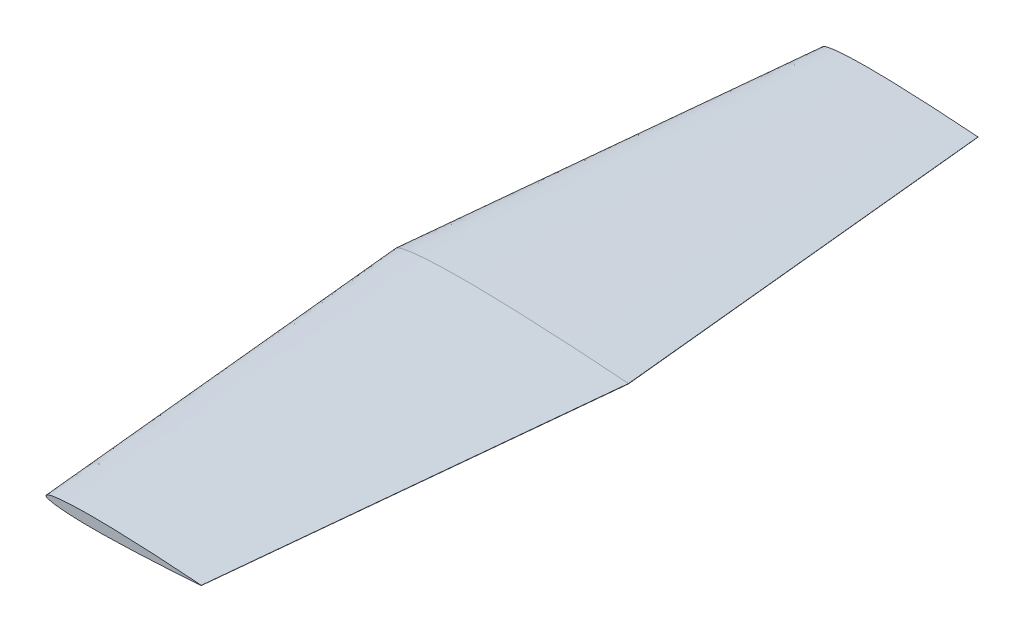
ISO-10303-21;
HEADER;
FILE_DESCRIPTION(('STEP AP214'),'2;1');
FILE_NAME('part.step','',(''),(''),'','','');
FILE_SCHEMA(('AUTOMOTIVE_DESIGN { 1 0 10303 214 1 1 1 1 }'));
ENDSEC;
DATA;
#1=APPLICATION_CONTEXT('core data for automotive mechanical design processes');
#2=APPLICATION_PROTOCOL_DEFINITION('international standard','automotive_design',2000,#1);
#3=PRODUCT_CONTEXT('',#1,'mechanical');
#4=PRODUCT('Part','Part','',(#3));
#5=PRODUCT_RELATED_PRODUCT_CATEGORY('part','',(#4));
#6=PRODUCT_DEFINITION_FORMATION('','',#4);
#7=PRODUCT_DEFINITION_CONTEXT('part definition',#1,'design');
#8=PRODUCT_DEFINITION('design','',#6,#7);
#9=PRODUCT_DEFINITION_SHAPE('','',#8);
#10=(LENGTH_UNIT() NAMED_UNIT(*) SI_UNIT(.MILLI.,.METRE.));
#11=(NAMED_UNIT(*) PLANE_ANGLE_UNIT() SI_UNIT($,.RADIAN.));
#12=(NAMED_UNIT(*) SI_UNIT($,.STERADIAN.) SOLID_ANGLE_UNIT());
#13=UNCERTAINTY_MEASURE_WITH_UNIT(LENGTH_MEASURE(1.E-05),#10,'distance_accuracy_value','');
#14=(GEOMETRIC_REPRESENTATION_CONTEXT(3) GLOBAL_UNCERTAINTY_ASSIGNED_CONTEXT((#13)) GLOBAL_UNIT_ASSIGNED_CONTEXT((#10,
#11,#12)) REPRESENTATION_CONTEXT('',''));
#15=CARTESIAN_POINT('',(0.,0.,0.));
#16=DIRECTION('',(0.,0.,1.));
#17=DIRECTION('',(1.,0.,0.));
#18=AXIS2_PLACEMENT_3D('',#15,#16,#17);
#19=CARTESIAN_POINT('',(30.4800001226268,0.000349459675954821,304.8));
#20=DIRECTION('',(0.,0.,-1.));
#21=DIRECTION('',(-1.,0.,0.));
#22=AXIS2_PLACEMENT_3D('',#19,#20,#21);
#23=PLANE('',#22);
#24=CARTESIAN_POINT('',(152.4,0.,304.8));
#25=CARTESIAN_POINT('',(147.533653871082,0.38251094407834,304.8));
#26=CARTESIAN_POINT('',(137.833966293067,1.08897194712108,304.8));
#27=CARTESIAN_POINT('',(122.258297932429,2.08093581236501,304.8));
#28=CARTESIAN_POINT('',(106.807179241957,2.91624861625816,304.8));
#29=CARTESIAN_POINT('',(93.009840409047,3.50614621448431,304.8));
#30=CARTESIAN_POINT('',(81.9861263173243,3.84811026205105,304.8));
#31=CARTESIAN_POINT('',(72.7605207886575,4.02349433648937,304.8));
#32=CARTESIAN_POINT('',(63.9941426865938,4.0558165498287,304.8));
#33=CARTESIAN_POINT('',(57.0756497707235,3.94665076386842,304.8));
#34=CARTESIAN_POINT('',(51.9325294626256,3.76714749278911,304.8));
#35=CARTESIAN_POINT('',(48.4242684817791,3.59398385287236,304.8));
#36=CARTESIAN_POINT('',(45.1810225085514,3.38060508510462,304.8));
#37=CARTESIAN_POINT('',(42.2227177919065,3.12849009249765,304.8));
#38=CARTESIAN_POINT('',(39.5674648043959,2.8406056454015,304.8));
#39=CARTESIAN_POINT('',(37.2314111811434,2.52015422985372,304.8));
#40=CARTESIAN_POINT('',(35.2281616987781,2.17127756223696,304.8));
#41=CARTESIAN_POINT('',(33.5699899186169,1.79622978628432,304.8));
#42=CARTESIAN_POINT('',(32.2612918625158,1.40457182472168,304.8));
#43=CARTESIAN_POINT('',(31.3100638756045,0.98677947663402,304.8));
#44=CARTESIAN_POINT('',(30.6796340067174,0.566158578880305,304.8));
#45=CARTESIAN_POINT('',(30.3981273738036,0.000406923399632427,304.8));
#46=CARTESIAN_POINT('',(30.6788395657118,-0.565739334529939,304.8));
#47=CARTESIAN_POINT('',(31.3086783744998,-0.987244772403172,304.8));
#48=CARTESIAN_POINT('',(32.2593189557769,-1.4063719779545,304.8));
#49=CARTESIAN_POINT('',(33.5674659397252,-1.79986661487492,304.8));
#50=CARTESIAN_POINT('',(35.2251096196686,-2.17724164997093,304.8));
#51=CARTESIAN_POINT('',(37.2278673990544,-2.52892999910048,304.8));
#52=CARTESIAN_POINT('',(39.5634688928718,-2.85266029196128,304.8));
#53=CARTESIAN_POINT('',(42.2183151517549,-3.14427171879218,304.8));
#54=CARTESIAN_POINT('',(45.176263051921,-3.40053912975998,304.8));
#55=CARTESIAN_POINT('',(49.6702369802134,-3.70254168714988,304.8));
#56=CARTESIAN_POINT('',(55.8970983238272,-3.96304546156846,304.8));
#57=CARTESIAN_POINT('',(63.9884216246175,-4.10216132772887,304.8));
#58=CARTESIAN_POINT('',(72.7548365500238,-4.0820872303255,304.8));
#59=CARTESIAN_POINT('',(83.5758846244706,-3.8915400795507,304.8));
#60=CARTESIAN_POINT('',(94.5992120483107,-3.53219186224239,304.8));
#61=CARTESIAN_POINT('',(107.003167037018,-2.99906507109771,304.8));
#62=CARTESIAN_POINT('',(118.606585566789,-2.40431872015219,304.8));
#63=CARTESIAN_POINT('',(132.638123697716,-1.57653391106616,304.8));
#64=CARTESIAN_POINT('',(143.669870137525,-0.830089724390264,304.8));
#65=CARTESIAN_POINT('',(150.790621778329,-0.294664462290499,304.8));
#66=CARTESIAN_POINT('',(152.337250862248,-0.175278514748908,304.8));
#67=CARTESIAN_POINT('',(152.399880371046,-0.170444076207932,304.8));
#68=B_SPLINE_CURVE_WITH_KNOTS('',3,(#24,#25,#26,#27,#28,#29,#30,#31,#32,#33,#34,#35,#36,#37,#38,
#39,#40,#41,#42,#43,#44,#45,#46,#47,#48,#49,#50,#51,#52,#53,#54,#55,#56,#57,#58,#59,#60,#61,#62,
#63,#64,#65,#66,#67),.UNSPECIFIED.,.F.,.F.,(4,1,1,1,1,1,1,1,1,1,1,1,1,1,1,1,1,1,1,1,1,1,1,1,1,1,
1,1,1,1,1,1,1,1,1,1,1,1,1,1,1,4),(0.,0.0596259329175186,0.118794316145622,0.190640969797917,
0.248634388187655,0.287480222013132,0.325358639441238,0.361342977619647,0.394558133703493,
0.409873175250072,0.424202725033005,0.437462162530302,0.44957308952056,0.460466924896069,
0.470082555788664,0.478371165069195,0.485296058318901,0.490841915805551,0.495027345223261,
0.497956576323911,0.5,0.502043423676089,0.504972654776739,0.509158084194449,0.514703941681099,
0.521628834930805,0.529917444211336,0.539533075103931,0.55042691047944,0.562537837469698,
0.575797274966995,0.605441866296506,0.638657022380353,0.674641360558762,0.712519777986868,
0.770853679587024,0.809359030202083,0.864173424708743,0.912774372266273,0.981051672806997,
0.999232702632466,1.),.UNSPECIFIED.);
#69=CARTESIAN_POINT('',(152.4,0.,304.8));
#70=VERTEX_POINT('',#69);
#71=CARTESIAN_POINT('',(152.399880371046,-0.170444076207932,304.8));
#72=VERTEX_POINT('',#71);
#73=EDGE_CURVE('E103',#70,#72,#68,.T.);
#74=ORIENTED_EDGE('',*,*,#73,.T.);
#75=DIRECTION('',(0.00070186613205375,0.999999753691936,0.));
#76=VECTOR('',#75,1.);
#77=CARTESIAN_POINT('',(152.4,0.,304.8));
#78=LINE('',#77,#76);
#79=EDGE_CURVE('E12',#72,#70,#78,.T.);
#80=ORIENTED_EDGE('',*,*,#79,.T.);
#81=EDGE_LOOP('',(#74,#80));
#82=FACE_BOUND('',#81,.T.);
#83=ADVANCED_FACE('F93',(#82),#23,.F.);
#84=CARTESIAN_POINT('',(182.88,0.,0.));
#85=CARTESIAN_POINT('',(152.4,0.,304.8));
#86=CARTESIAN_POINT('',(175.580480806622,0.573766416117493,0.));
#87=CARTESIAN_POINT('',(147.533653871082,0.38251094407834,304.8));
#88=CARTESIAN_POINT('',(161.030949439601,1.63345792068157,0.));
#89=CARTESIAN_POINT('',(137.833966293067,1.08897194712108,304.8));
#90=CARTESIAN_POINT('',(137.667446898643,3.12140371854741,0.));
#91=CARTESIAN_POINT('',(122.258297932429,2.08093581236501,304.8));
#92=CARTESIAN_POINT('',(114.490768862935,4.37437292438708,0.));
#93=CARTESIAN_POINT('',(106.807179241957,2.91624861625816,304.8));
#94=CARTESIAN_POINT('',(93.7947606135705,5.25921932172626,0.));
#95=CARTESIAN_POINT('',(93.009840409047,3.50614621448431,304.8));
#96=CARTESIAN_POINT('',(77.2591894759865,5.77216539307632,0.));
#97=CARTESIAN_POINT('',(81.9861263173243,3.84811026205105,304.8));
#98=CARTESIAN_POINT('',(63.4207811829863,6.03524150473379,0.));
#99=CARTESIAN_POINT('',(72.7605207886575,4.02349433648937,304.8));
#100=CARTESIAN_POINT('',(50.2712140298907,6.08372482474274,0.));
#101=CARTESIAN_POINT('',(63.9941426865938,4.0558165498287,304.8));
#102=CARTESIAN_POINT('',(39.8934746560852,5.9199761458023,0.));
#103=CARTESIAN_POINT('',(57.0756497707235,3.94665076386842,304.8));
#104=CARTESIAN_POINT('',(32.1787941939384,5.65072123918332,0.));
#105=CARTESIAN_POINT('',(51.9325294626256,3.76714749278911,304.8));
#106=CARTESIAN_POINT('',(26.9164027226685,5.39097577930818,0.));
#107=CARTESIAN_POINT('',(48.4242684817791,3.59398385287236,304.8));
#108=CARTESIAN_POINT('',(22.0515337628271,5.07090762765656,0.));
#109=CARTESIAN_POINT('',(45.1810225085514,3.38060508510462,304.8));
#110=CARTESIAN_POINT('',(17.6140766878598,4.6927351387461,0.));
#111=CARTESIAN_POINT('',(42.2227177919065,3.12849009249765,304.8));
#112=CARTESIAN_POINT('',(13.6311972065938,4.26090846810185,0.));
#113=CARTESIAN_POINT('',(39.5674648043959,2.8406056454015,304.8));
#114=CARTESIAN_POINT('',(10.127116771715,3.78023134478019,0.));
#115=CARTESIAN_POINT('',(37.2314111811434,2.52015422985372,304.8));
#116=CARTESIAN_POINT('',(7.12224254816719,3.25691634335503,0.));
#117=CARTESIAN_POINT('',(35.2281616987781,2.17127756223696,304.8));
#118=CARTESIAN_POINT('',(4.63498487792534,2.69434467942608,0.));
#119=CARTESIAN_POINT('',(33.5699899186169,1.79622978628432,304.8));
#120=CARTESIAN_POINT('',(2.67193779377372,2.10685773708211,0.));
#121=CARTESIAN_POINT('',(32.2612918625158,1.40457182472168,304.8));
#122=CARTESIAN_POINT('',(1.24509581340664,1.48016921495062,0.));
#123=CARTESIAN_POINT('',(31.3100638756045,0.98677947663402,304.8));
#124=CARTESIAN_POINT('',(0.299451010075983,0.849237868320046,0.));
#125=CARTESIAN_POINT('',(30.6796340067174,0.566158578880305,304.8));
#126=CARTESIAN_POINT('',(-0.122808939294576,0.000610385099033156,0.));
#127=CARTESIAN_POINT('',(30.3981273738036,0.000406923399632427,304.8));
#128=CARTESIAN_POINT('',(0.298259348567604,-0.848609001795312,0.));
#129=CARTESIAN_POINT('',(30.6788395657118,-0.565739334529939,304.8));
#130=CARTESIAN_POINT('',(1.24301756174956,-1.48086715860516,0.));
#131=CARTESIAN_POINT('',(31.3086783744998,-0.987244772403172,304.8));
#132=CARTESIAN_POINT('',(2.66897843366527,-2.10955796693214,0.));
#133=CARTESIAN_POINT('',(32.2593189557769,-1.4063719779545,304.8));
#134=CARTESIAN_POINT('',(4.63119890958769,-2.69979992231278,0.));
#135=CARTESIAN_POINT('',(33.5674659397252,-1.79986661487492,304.8));
#136=CARTESIAN_POINT('',(7.1176644295028,-3.2658624749568,0.));
#137=CARTESIAN_POINT('',(35.2251096196686,-2.17724164997093,304.8));
#138=CARTESIAN_POINT('',(10.1218010985815,-3.7933949986511,0.));
#139=CARTESIAN_POINT('',(37.2278673990544,-2.52892999910048,304.8));
#140=CARTESIAN_POINT('',(13.6252033393076,-4.2789904379423,0.));
#141=CARTESIAN_POINT('',(39.5634688928718,-2.85266029196128,304.8));
#142=CARTESIAN_POINT('',(17.6074727276324,-4.71640757818865,0.));
#143=CARTESIAN_POINT('',(42.2183151517549,-3.14427171879218,304.8));
#144=CARTESIAN_POINT('',(22.0443945778815,-5.10080869464034,0.));
#145=CARTESIAN_POINT('',(45.176263051921,-3.40053912975998,304.8));
#146=CARTESIAN_POINT('',(28.7853554703201,-5.55381253072517,0.));
#147=CARTESIAN_POINT('',(49.6702369802134,-3.70254168714988,304.8));
#148=CARTESIAN_POINT('',(38.1256474857407,-5.94456819235302,0.));
#149=CARTESIAN_POINT('',(55.8970983238272,-3.96304546156846,304.8));
#150=CARTESIAN_POINT('',(50.2626324369262,-6.15324199159361,0.));
#151=CARTESIAN_POINT('',(63.9884216246175,-4.10216132772887,304.8));
#152=CARTESIAN_POINT('',(63.4122548250357,-6.12313084548852,0.));
#153=CARTESIAN_POINT('',(72.7548365500238,-4.0820872303255,304.8));
#154=CARTESIAN_POINT('',(79.643826936706,-5.83731011932629,0.));
#155=CARTESIAN_POINT('',(83.5758846244706,-3.8915400795507,304.8));
#156=CARTESIAN_POINT('',(96.178818072466,-5.29828779336379,0.));
#157=CARTESIAN_POINT('',(94.5992120483107,-3.53219186224239,304.8));
#158=CARTESIAN_POINT('',(114.784750555528,-4.49859760664672,0.));
#159=CARTESIAN_POINT('',(107.003167037018,-2.99906507109771,304.8));
#160=CARTESIAN_POINT('',(132.189878350184,-3.6064780802284,0.));
#161=CARTESIAN_POINT('',(118.606585566789,-2.40431872015219,304.8));
#162=CARTESIAN_POINT('',(153.237185546575,-2.3648008665993,0.));
#163=CARTESIAN_POINT('',(132.638123697716,-1.57653391106616,304.8));
#164=CARTESIAN_POINT('',(169.784805206288,-1.24513458658543,0.));
#165=CARTESIAN_POINT('',(143.669870137525,-0.830089724390264,304.8));
#166=CARTESIAN_POINT('',(180.465932667493,-0.441996693435762,0.));
#167=CARTESIAN_POINT('',(150.790621778329,-0.294664462290499,304.8));
#168=CARTESIAN_POINT('',(182.785876293372,-0.262917772123379,0.));
#169=CARTESIAN_POINT('',(152.337250862248,-0.175278514748908,304.8));
#170=CARTESIAN_POINT('',(182.879820556569,-0.255666114311894,0.));
#171=CARTESIAN_POINT('',(152.399880371046,-0.170444076207932,304.8));
#172=B_SPLINE_SURFACE_WITH_KNOTS('',3,1,((#84,#85),(#86,#87),(#88,#89),(#90,#91),(#92,#93),(#94,
#95),(#96,#97),(#98,#99),(#100,#101),(#102,#103),(#104,#105),(#106,#107),(#108,#109),(#110,
#111),(#112,#113),(#114,#115),(#116,#117),(#118,#119),(#120,#121),(#122,#123),(#124,#125),(#126,
#127),(#128,#129),(#130,#131),(#132,#133),(#134,#135),(#136,#137),(#138,#139),(#140,#141),(#142,
#143),(#144,#145),(#146,#147),(#148,#149),(#150,#151),(#152,#153),(#154,#155),(#156,#157),(#158,
#159),(#160,#161),(#162,#163),(#164,#165),(#166,#167),(#168,#169),(#170,#171)),.UNSPECIFIED.,
.F.,.F.,.F.,(4,1,1,1,1,1,1,1,1,1,1,1,1,1,1,1,1,1,1,1,1,1,1,1,1,1,1,1,1,1,1,1,1,1,1,1,1,1,1,1,1,
4),(2,2),(0.,0.0596259329175186,0.118794316145622,0.190640969797917,0.248634388187655,
0.287480222013132,0.325358639441238,0.361342977619647,0.394558133703493,0.409873175250072,
0.424202725033005,0.437462162530302,0.44957308952056,0.460466924896069,0.470082555788664,
0.478371165069195,0.485296058318901,0.490841915805551,0.495027345223261,0.497956576323911,0.5,
0.502043423676089,0.504972654776739,0.509158084194449,0.514703941681099,0.521628834930805,
0.529917444211336,0.539533075103931,0.55042691047944,0.562537837469698,0.575797274966995,
0.605441866296506,0.638657022380353,0.674641360558762,0.712519777986868,0.770853679587024,
0.809359030202083,0.864173424708743,0.912774372266273,0.981051672806997,0.999232702632466,1.),
(0.,1.),.UNSPECIFIED.);
#173=CARTESIAN_POINT('',(182.88,0.,0.));
#174=CARTESIAN_POINT('',(175.580480806622,0.573766416117493,0.));
#175=CARTESIAN_POINT('',(161.030949439601,1.63345792068157,0.));
#176=CARTESIAN_POINT('',(137.667446898643,3.12140371854741,0.));
#177=CARTESIAN_POINT('',(114.490768862935,4.37437292438708,0.));
#178=CARTESIAN_POINT('',(93.7947606135705,5.25921932172626,0.));
#179=CARTESIAN_POINT('',(77.2591894759865,5.77216539307632,0.));
#180=CARTESIAN_POINT('',(63.4207811829863,6.03524150473379,0.));
#181=CARTESIAN_POINT('',(50.2712140298907,6.08372482474274,0.));
#182=CARTESIAN_POINT('',(39.8934746560852,5.9199761458023,0.));
#183=CARTESIAN_POINT('',(32.1787941939384,5.65072123918332,0.));
#184=CARTESIAN_POINT('',(26.9164027226685,5.39097577930818,0.));
#185=CARTESIAN_POINT('',(22.0515337628271,5.07090762765656,0.));
#186=CARTESIAN_POINT('',(17.6140766878598,4.6927351387461,0.));
#187=CARTESIAN_POINT('',(13.6311972065938,4.26090846810185,0.));
#188=CARTESIAN_POINT('',(10.127116771715,3.78023134478019,0.));
#189=CARTESIAN_POINT('',(7.12224254816719,3.25691634335503,0.));
#190=CARTESIAN_POINT('',(4.63498487792534,2.69434467942608,0.));
#191=CARTESIAN_POINT('',(2.67193779377372,2.10685773708211,0.));
#192=CARTESIAN_POINT('',(1.24509581340664,1.48016921495062,0.));
#193=CARTESIAN_POINT('',(0.299451010075983,0.849237868320046,0.));
#194=CARTESIAN_POINT('',(-0.122808939294576,0.000610385099033156,0.));
#195=CARTESIAN_POINT('',(0.298259348567604,-0.848609001795312,0.));
#196=CARTESIAN_POINT('',(1.24301756174956,-1.48086715860516,0.));
#197=CARTESIAN_POINT('',(2.66897843366527,-2.10955796693214,0.));
#198=CARTESIAN_POINT('',(4.63119890958769,-2.69979992231278,0.));
#199=CARTESIAN_POINT('',(7.1176644295028,-3.2658624749568,0.));
#200=CARTESIAN_POINT('',(10.1218010985815,-3.7933949986511,0.));
#201=CARTESIAN_POINT('',(13.6252033393076,-4.2789904379423,0.));
#202=CARTESIAN_POINT('',(17.6074727276324,-4.71640757818865,0.));
#203=CARTESIAN_POINT('',(22.0443945778815,-5.10080869464034,0.));
#204=CARTESIAN_POINT('',(28.7853554703201,-5.55381253072517,0.));
#205=CARTESIAN_POINT('',(38.1256474857407,-5.94456819235302,0.));
#206=CARTESIAN_POINT('',(50.2626324369262,-6.15324199159361,0.));
#207=CARTESIAN_POINT('',(63.4122548250357,-6.12313084548852,0.));
#208=CARTESIAN_POINT('',(79.643826936706,-5.83731011932629,0.));
#209=CARTESIAN_POINT('',(96.178818072466,-5.29828779336379,0.));
#210=CARTESIAN_POINT('',(114.784750555528,-4.49859760664672,0.));
#211=CARTESIAN_POINT('',(132.189878350184,-3.6064780802284,0.));
#212=CARTESIAN_POINT('',(153.237185546575,-2.3648008665993,0.));
#213=CARTESIAN_POINT('',(169.784805206288,-1.24513458658543,0.));
#214=CARTESIAN_POINT('',(180.465932667493,-0.441996693435762,0.));
#215=CARTESIAN_POINT('',(182.785876293372,-0.262917772123379,0.));
#216=CARTESIAN_POINT('',(182.879820556569,-0.255666114311894,0.));
#217=B_SPLINE_CURVE_WITH_KNOTS('',3,(#173,#174,#175,#176,#177,#178,#179,#180,#181,#182,#183,
#184,#185,#186,#187,#188,#189,#190,#191,#192,#193,#194,#195,#196,#197,#198,#199,#200,#201,#202,
#203,#204,#205,#206,#207,#208,#209,#210,#211,#212,#213,#214,#215,#216),.UNSPECIFIED.,.F.,.F.,(4,
1,1,1,1,1,1,1,1,1,1,1,1,1,1,1,1,1,1,1,1,1,1,1,1,1,1,1,1,1,1,1,1,1,1,1,1,1,1,1,1,4),(0.,
0.0596259329175186,0.118794316145622,0.190640969797917,0.248634388187655,0.287480222013132,
0.325358639441238,0.361342977619647,0.394558133703493,0.409873175250072,0.424202725033005,
0.437462162530302,0.44957308952056,0.460466924896069,0.470082555788664,0.478371165069195,
0.485296058318901,0.490841915805551,0.495027345223261,0.497956576323911,0.5,0.502043423676089,
0.504972654776739,0.509158084194449,0.514703941681099,0.521628834930805,0.529917444211336,
0.539533075103931,0.55042691047944,0.562537837469698,0.575797274966995,0.605441866296506,
0.638657022380353,0.674641360558762,0.712519777986868,0.770853679587024,0.809359030202083,
0.864173424708743,0.912774372266273,0.981051672806997,0.999232702632466,1.),.UNSPECIFIED.);
#218=CARTESIAN_POINT('',(182.88,0.,0.));
#219=VERTEX_POINT('',#218);
#220=CARTESIAN_POINT('',(182.879820556569,-0.255666114311894,0.));
#221=VERTEX_POINT('',#220);
#222=EDGE_CURVE('E97',#219,#221,#217,.T.);
#223=DIRECTION('',(-0.0995035218356372,0.000278212256249202,0.995037171034452));
#224=VECTOR('',#223,1.);
#225=CARTESIAN_POINT('',(167.639850463808,-0.213055095259913,152.4));
#226=LINE('',#225,#224);
#227=EDGE_CURVE('E111',#221,#72,#226,.T.);
#228=DIRECTION('',(0.0995037190209989,0.,-0.995037190209989));
#229=VECTOR('',#228,1.);
#230=CARTESIAN_POINT('',(167.64,0.,152.4));
#231=LINE('',#230,#229);
#232=EDGE_CURVE('E151',#70,#219,#231,.T.);
#233=ORIENTED_EDGE('',*,*,#222,.T.);
#234=ORIENTED_EDGE('',*,*,#227,.T.);
#235=ORIENTED_EDGE('',*,*,#73,.F.);
#236=ORIENTED_EDGE('',*,*,#232,.T.);
#237=EDGE_LOOP('',(#233,#234,#235,#236));
#238=FACE_BOUND('',#237,.T.);
#239=ADVANCED_FACE('F154',(#238),#172,.T.);
#240=CARTESIAN_POINT('',(181.069218616188,-0.12708638340654,18.1069218616188));
#241=DIRECTION('',(-0.995036947550895,0.000698382905645459,-0.0995036947550895));
#242=DIRECTION('',(-0.0995037190209988,0.,0.995037190209989));
#243=AXIS2_PLACEMENT_3D('',#240,#241,#242);
#244=PLANE('',#243);
#245=ORIENTED_EDGE('',*,*,#232,.F.);
#246=ORIENTED_EDGE('',*,*,#79,.F.);
#247=ORIENTED_EDGE('',*,*,#227,.F.);
#248=DIRECTION('',(0.000701866131619513,0.999999753691936,0.));
#249=VECTOR('',#248,1.);
#250=CARTESIAN_POINT('',(182.88,0.,0.));
#251=LINE('',#250,#249);
#252=EDGE_CURVE('E144',#221,#219,#251,.T.);
#253=ORIENTED_EDGE('',*,*,#252,.T.);
#254=EDGE_LOOP('',(#245,#246,#247,#253));
#255=FACE_BOUND('',#254,.T.);
#256=ADVANCED_FACE('F158',(#255),#244,.F.);
#257=CARTESIAN_POINT('',(30.4800001226268,0.000349459675954821,-304.8));
#258=DIRECTION('',(0.,0.,1.));
#259=DIRECTION('',(-1.,0.,0.));
#260=AXIS2_PLACEMENT_3D('',#257,#258,#259);
#261=PLANE('',#260);
#262=CARTESIAN_POINT('',(152.4,0.,-304.8));
#263=CARTESIAN_POINT('',(147.533653871082,0.38251094407834,-304.8));
#264=CARTESIAN_POINT('',(137.833966293067,1.08897194712108,-304.8));
#265=CARTESIAN_POINT('',(122.258297932429,2.08093581236501,-304.8));
#266=CARTESIAN_POINT('',(106.807179241957,2.91624861625816,-304.8));
#267=CARTESIAN_POINT('',(93.009840409047,3.50614621448431,-304.8));
#268=CARTESIAN_POINT('',(81.9861263173243,3.84811026205105,-304.8));
#269=CARTESIAN_POINT('',(72.7605207886575,4.02349433648937,-304.8));
#270=CARTESIAN_POINT('',(63.9941426865938,4.0558165498287,-304.8));
#271=CARTESIAN_POINT('',(57.0756497707235,3.94665076386842,-304.8));
#272=CARTESIAN_POINT('',(51.9325294626256,3.76714749278911,-304.8));
#273=CARTESIAN_POINT('',(48.4242684817791,3.59398385287236,-304.8));
#274=CARTESIAN_POINT('',(45.1810225085514,3.38060508510462,-304.8));
#275=CARTESIAN_POINT('',(42.2227177919065,3.12849009249765,-304.8));
#276=CARTESIAN_POINT('',(39.5674648043959,2.8406056454015,-304.8));
#277=CARTESIAN_POINT('',(37.2314111811434,2.52015422985372,-304.8));
#278=CARTESIAN_POINT('',(35.2281616987781,2.17127756223696,-304.8));
#279=CARTESIAN_POINT('',(33.5699899186169,1.79622978628432,-304.8));
#280=CARTESIAN_POINT('',(32.2612918625158,1.40457182472168,-304.8));
#281=CARTESIAN_POINT('',(31.3100638756045,0.98677947663402,-304.8));
#282=CARTESIAN_POINT('',(30.6796340067174,0.566158578880305,-304.8));
#283=CARTESIAN_POINT('',(30.3981273738036,0.000406923399632427,-304.8));
#284=CARTESIAN_POINT('',(30.6788395657118,-0.565739334529939,-304.8));
#285=CARTESIAN_POINT('',(31.3086783744998,-0.987244772403172,-304.8));
#286=CARTESIAN_POINT('',(32.2593189557769,-1.4063719779545,-304.8));
#287=CARTESIAN_POINT('',(33.5674659397252,-1.79986661487492,-304.8));
#288=CARTESIAN_POINT('',(35.2251096196686,-2.17724164997093,-304.8));
#289=CARTESIAN_POINT('',(37.2278673990544,-2.52892999910048,-304.8));
#290=CARTESIAN_POINT('',(39.5634688928718,-2.85266029196128,-304.8));
#291=CARTESIAN_POINT('',(42.2183151517549,-3.14427171879218,-304.8));
#292=CARTESIAN_POINT('',(45.176263051921,-3.40053912975998,-304.8));
#293=CARTESIAN_POINT('',(49.6702369802134,-3.70254168714988,-304.8));
#294=CARTESIAN_POINT('',(55.8970983238272,-3.96304546156846,-304.8));
#295=CARTESIAN_POINT('',(63.9884216246175,-4.10216132772887,-304.8));
#296=CARTESIAN_POINT('',(72.7548365500238,-4.0820872303255,-304.8));
#297=CARTESIAN_POINT('',(83.5758846244706,-3.8915400795507,-304.8));
#298=CARTESIAN_POINT('',(94.5992120483107,-3.53219186224239,-304.8));
#299=CARTESIAN_POINT('',(107.003167037018,-2.99906507109771,-304.8));
#300=CARTESIAN_POINT('',(118.606585566789,-2.40431872015219,-304.8));
#301=CARTESIAN_POINT('',(132.638123697716,-1.57653391106616,-304.8));
#302=CARTESIAN_POINT('',(143.669870137525,-0.830089724390264,-304.8));
#303=CARTESIAN_POINT('',(150.790621778329,-0.294664462290499,-304.8));
#304=CARTESIAN_POINT('',(152.337250862248,-0.175278514748908,-304.8));
#305=CARTESIAN_POINT('',(152.399880371046,-0.170444076207932,-304.8));
#306=B_SPLINE_CURVE_WITH_KNOTS('',3,(#262,#263,#264,#265,#266,#267,#268,#269,#270,#271,#272,
#273,#274,#275,#276,#277,#278,#279,#280,#281,#282,#283,#284,#285,#286,#287,#288,#289,#290,#291,
#292,#293,#294,#295,#296,#297,#298,#299,#300,#301,#302,#303,#304,#305),.UNSPECIFIED.,.F.,.F.,(4,
1,1,1,1,1,1,1,1,1,1,1,1,1,1,1,1,1,1,1,1,1,1,1,1,1,1,1,1,1,1,1,1,1,1,1,1,1,1,1,1,4),(0.,
0.0596259329175186,0.118794316145622,0.190640969797917,0.248634388187655,0.287480222013132,
0.325358639441238,0.361342977619647,0.394558133703493,0.409873175250072,0.424202725033005,
0.437462162530302,0.44957308952056,0.460466924896069,0.470082555788664,0.478371165069195,
0.485296058318901,0.490841915805551,0.495027345223261,0.497956576323911,0.5,0.502043423676089,
0.504972654776739,0.509158084194449,0.514703941681099,0.521628834930805,0.529917444211336,
0.539533075103931,0.55042691047944,0.562537837469698,0.575797274966995,0.605441866296506,
0.638657022380353,0.674641360558762,0.712519777986868,0.770853679587024,0.809359030202083,
0.864173424708743,0.912774372266273,0.981051672806997,0.999232702632466,1.),.UNSPECIFIED.);
#307=CARTESIAN_POINT('',(152.4,0.,-304.8));
#308=VERTEX_POINT('',#307);
#309=CARTESIAN_POINT('',(152.399880371046,-0.170444076207932,-304.8));
#310=VERTEX_POINT('',#309);
#311=EDGE_CURVE('E136',#308,#310,#306,.T.);
#312=ORIENTED_EDGE('',*,*,#311,.F.);
#313=CARTESIAN_POINT('',(152.399880371046,-0.170444076207932,-304.8));
#314=DIRECTION('',(0.000701866132053739,0.999999753691936,3.2568534379976E-13));
#315=VECTOR('',#314,1.);
#316=LINE('',#313,#315);
#317=EDGE_CURVE('E155',#310,#308,#316,.T.);
#318=ORIENTED_EDGE('',*,*,#317,.F.);
#319=EDGE_LOOP('',(#312,#318));
#320=FACE_BOUND('',#319,.T.);
#321=ADVANCED_FACE('F178',(#320),#261,.F.);
#322=CARTESIAN_POINT('',(182.88,0.,0.));
#323=CARTESIAN_POINT('',(152.4,0.,-304.8));
#324=CARTESIAN_POINT('',(175.580480806622,0.573766416117493,0.));
#325=CARTESIAN_POINT('',(147.533653871082,0.38251094407834,-304.8));
#326=CARTESIAN_POINT('',(161.030949439601,1.63345792068157,0.));
#327=CARTESIAN_POINT('',(137.833966293067,1.08897194712108,-304.8));
#328=CARTESIAN_POINT('',(137.667446898643,3.12140371854741,0.));
#329=CARTESIAN_POINT('',(122.258297932429,2.08093581236501,-304.8));
#330=CARTESIAN_POINT('',(114.490768862935,4.37437292438708,0.));
#331=CARTESIAN_POINT('',(106.807179241957,2.91624861625816,-304.8));
#332=CARTESIAN_POINT('',(93.7947606135705,5.25921932172626,0.));
#333=CARTESIAN_POINT('',(93.009840409047,3.50614621448431,-304.8));
#334=CARTESIAN_POINT('',(77.2591894759865,5.77216539307632,0.));
#335=CARTESIAN_POINT('',(81.9861263173243,3.84811026205105,-304.8));
#336=CARTESIAN_POINT('',(63.4207811829863,6.03524150473379,0.));
#337=CARTESIAN_POINT('',(72.7605207886575,4.02349433648937,-304.8));
#338=CARTESIAN_POINT('',(50.2712140298907,6.08372482474274,0.));
#339=CARTESIAN_POINT('',(63.9941426865938,4.0558165498287,-304.8));
#340=CARTESIAN_POINT('',(39.8934746560852,5.9199761458023,0.));
#341=CARTESIAN_POINT('',(57.0756497707235,3.94665076386842,-304.8));
#342=CARTESIAN_POINT('',(32.1787941939384,5.65072123918332,0.));
#343=CARTESIAN_POINT('',(51.9325294626256,3.76714749278911,-304.8));
#344=CARTESIAN_POINT('',(26.9164027226685,5.39097577930818,0.));
#345=CARTESIAN_POINT('',(48.4242684817791,3.59398385287236,-304.8));
#346=CARTESIAN_POINT('',(22.0515337628271,5.07090762765656,0.));
#347=CARTESIAN_POINT('',(45.1810225085514,3.38060508510462,-304.8));
#348=CARTESIAN_POINT('',(17.6140766878598,4.6927351387461,0.));
#349=CARTESIAN_POINT('',(42.2227177919065,3.12849009249765,-304.8));
#350=CARTESIAN_POINT('',(13.6311972065938,4.26090846810185,0.));
#351=CARTESIAN_POINT('',(39.5674648043959,2.8406056454015,-304.8));
#352=CARTESIAN_POINT('',(10.127116771715,3.78023134478019,0.));
#353=CARTESIAN_POINT('',(37.2314111811434,2.52015422985372,-304.8));
#354=CARTESIAN_POINT('',(7.12224254816719,3.25691634335503,0.));
#355=CARTESIAN_POINT('',(35.2281616987781,2.17127756223696,-304.8));
#356=CARTESIAN_POINT('',(4.63498487792534,2.69434467942608,0.));
#357=CARTESIAN_POINT('',(33.5699899186169,1.79622978628432,-304.8));
#358=CARTESIAN_POINT('',(2.67193779377372,2.10685773708211,0.));
#359=CARTESIAN_POINT('',(32.2612918625158,1.40457182472168,-304.8));
#360=CARTESIAN_POINT('',(1.24509581340664,1.48016921495062,0.));
#361=CARTESIAN_POINT('',(31.3100638756045,0.98677947663402,-304.8));
#362=CARTESIAN_POINT('',(0.299451010075983,0.849237868320046,0.));
#363=CARTESIAN_POINT('',(30.6796340067174,0.566158578880305,-304.8));
#364=CARTESIAN_POINT('',(-0.122808939294576,0.000610385099033156,0.));
#365=CARTESIAN_POINT('',(30.3981273738036,0.000406923399632427,-304.8));
#366=CARTESIAN_POINT('',(0.298259348567604,-0.848609001795312,0.));
#367=CARTESIAN_POINT('',(30.6788395657118,-0.565739334529939,-304.8));
#368=CARTESIAN_POINT('',(1.24301756174956,-1.48086715860516,0.));
#369=CARTESIAN_POINT('',(31.3086783744998,-0.987244772403172,-304.8));
#370=CARTESIAN_POINT('',(2.66897843366527,-2.10955796693214,0.));
#371=CARTESIAN_POINT('',(32.2593189557769,-1.4063719779545,-304.8));
#372=CARTESIAN_POINT('',(4.63119890958769,-2.69979992231278,0.));
#373=CARTESIAN_POINT('',(33.5674659397252,-1.79986661487492,-304.8));
#374=CARTESIAN_POINT('',(7.1176644295028,-3.2658624749568,0.));
#375=CARTESIAN_POINT('',(35.2251096196686,-2.17724164997093,-304.8));
#376=CARTESIAN_POINT('',(10.1218010985815,-3.7933949986511,0.));
#377=CARTESIAN_POINT('',(37.2278673990544,-2.52892999910048,-304.8));
#378=CARTESIAN_POINT('',(13.6252033393076,-4.2789904379423,0.));
#379=CARTESIAN_POINT('',(39.5634688928718,-2.85266029196128,-304.8));
#380=CARTESIAN_POINT('',(17.6074727276324,-4.71640757818865,0.));
#381=CARTESIAN_POINT('',(42.2183151517549,-3.14427171879218,-304.8));
#382=CARTESIAN_POINT('',(22.0443945778815,-5.10080869464034,0.));
#383=CARTESIAN_POINT('',(45.176263051921,-3.40053912975998,-304.8));
#384=CARTESIAN_POINT('',(28.7853554703201,-5.55381253072517,0.));
#385=CARTESIAN_POINT('',(49.6702369802134,-3.70254168714988,-304.8));
#386=CARTESIAN_POINT('',(38.1256474857407,-5.94456819235302,0.));
#387=CARTESIAN_POINT('',(55.8970983238272,-3.96304546156846,-304.8));
#388=CARTESIAN_POINT('',(50.2626324369262,-6.15324199159361,0.));
#389=CARTESIAN_POINT('',(63.9884216246175,-4.10216132772887,-304.8));
#390=CARTESIAN_POINT('',(63.4122548250357,-6.12313084548852,0.));
#391=CARTESIAN_POINT('',(72.7548365500238,-4.0820872303255,-304.8));
#392=CARTESIAN_POINT('',(79.643826936706,-5.83731011932629,0.));
#393=CARTESIAN_POINT('',(83.5758846244706,-3.8915400795507,-304.8));
#394=CARTESIAN_POINT('',(96.178818072466,-5.29828779336379,0.));
#395=CARTESIAN_POINT('',(94.5992120483107,-3.53219186224239,-304.8));
#396=CARTESIAN_POINT('',(114.784750555528,-4.49859760664672,0.));
#397=CARTESIAN_POINT('',(107.003167037018,-2.99906507109771,-304.8));
#398=CARTESIAN_POINT('',(132.189878350184,-3.6064780802284,0.));
#399=CARTESIAN_POINT('',(118.606585566789,-2.40431872015219,-304.8));
#400=CARTESIAN_POINT('',(153.237185546575,-2.3648008665993,0.));
#401=CARTESIAN_POINT('',(132.638123697716,-1.57653391106616,-304.8));
#402=CARTESIAN_POINT('',(169.784805206288,-1.24513458658543,0.));
#403=CARTESIAN_POINT('',(143.669870137525,-0.830089724390264,-304.8));
#404=CARTESIAN_POINT('',(180.465932667493,-0.441996693435762,0.));
#405=CARTESIAN_POINT('',(150.790621778329,-0.294664462290499,-304.8));
#406=CARTESIAN_POINT('',(182.785876293372,-0.262917772123379,0.));
#407=CARTESIAN_POINT('',(152.337250862248,-0.175278514748908,-304.8));
#408=CARTESIAN_POINT('',(182.879820556569,-0.255666114311894,0.));
#409=CARTESIAN_POINT('',(152.399880371046,-0.170444076207932,-304.8));
#410=B_SPLINE_SURFACE_WITH_KNOTS('',3,1,((#322,#323),(#324,#325),(#326,#327),(#328,#329),(#330,
#331),(#332,#333),(#334,#335),(#336,#337),(#338,#339),(#340,#341),(#342,#343),(#344,#345),(#346,
#347),(#348,#349),(#350,#351),(#352,#353),(#354,#355),(#356,#357),(#358,#359),(#360,#361),(#362,
#363),(#364,#365),(#366,#367),(#368,#369),(#370,#371),(#372,#373),(#374,#375),(#376,#377),(#378,
#379),(#380,#381),(#382,#383),(#384,#385),(#386,#387),(#388,#389),(#390,#391),(#392,#393),(#394,
#395),(#396,#397),(#398,#399),(#400,#401),(#402,#403),(#404,#405),(#406,#407),(#408,#409)),
.UNSPECIFIED.,.F.,.F.,.F.,(4,1,1,1,1,1,1,1,1,1,1,1,1,1,1,1,1,1,1,1,1,1,1,1,1,1,1,1,1,1,1,1,1,1,
1,1,1,1,1,1,1,4),(2,2),(0.,0.0596259329175186,0.118794316145622,0.190640969797917,
0.248634388187655,0.287480222013132,0.325358639441238,0.361342977619647,0.394558133703493,
0.409873175250072,0.424202725033005,0.437462162530302,0.44957308952056,0.460466924896069,
0.470082555788664,0.478371165069195,0.485296058318901,0.490841915805551,0.495027345223261,
0.497956576323911,0.5,0.502043423676089,0.504972654776739,0.509158084194449,0.514703941681099,
0.521628834930805,0.529917444211336,0.539533075103931,0.55042691047944,0.562537837469698,
0.575797274966995,0.605441866296506,0.638657022380353,0.674641360558762,0.712519777986868,
0.770853679587024,0.809359030202083,0.864173424708743,0.912774372266273,0.981051672806997,
0.999232702632466,1.),(0.,1.),.UNSPECIFIED.);
#411=DIRECTION('',(0.0995037190209989,0.,0.995037190209989));
#412=VECTOR('',#411,1.);
#413=CARTESIAN_POINT('',(167.64,0.,-152.4));
#414=LINE('',#413,#412);
#415=EDGE_CURVE('E141',#308,#219,#414,.T.);
#416=DIRECTION('',(-0.0995035218356372,0.000278212256249202,-0.995037171034452));
#417=VECTOR('',#416,1.);
#418=CARTESIAN_POINT('',(167.639850463808,-0.213055095259913,-152.4));
#419=LINE('',#418,#417);
#420=EDGE_CURVE('E130',#221,#310,#419,.T.);
#421=ORIENTED_EDGE('',*,*,#222,.F.);
#422=ORIENTED_EDGE('',*,*,#415,.F.);
#423=ORIENTED_EDGE('',*,*,#311,.T.);
#424=ORIENTED_EDGE('',*,*,#420,.F.);
#425=EDGE_LOOP('',(#421,#422,#423,#424));
#426=FACE_BOUND('',#425,.T.);
#427=ADVANCED_FACE('F132',(#426),#410,.F.);
#428=CARTESIAN_POINT('',(181.069218616188,-0.12708638340654,-18.1069218616188));
#429=DIRECTION('',(-0.995036947550895,0.000698382905645459,0.0995036947550895));
#430=DIRECTION('',(-0.0995037190209988,0.,-0.995037190209989));
#431=AXIS2_PLACEMENT_3D('',#428,#429,#430);
#432=PLANE('',#431);
#433=ORIENTED_EDGE('',*,*,#415,.T.);
#434=ORIENTED_EDGE('',*,*,#252,.F.);
#435=ORIENTED_EDGE('',*,*,#420,.T.);
#436=ORIENTED_EDGE('',*,*,#317,.T.);
#437=EDGE_LOOP('',(#433,#434,#435,#436));
#438=FACE_BOUND('',#437,.T.);
#439=ADVANCED_FACE('F146',(#438),#432,.F.);
#440=CLOSED_SHELL('',(#83,#239,#256,#321,#427,#439));
#441=MANIFOLD_SOLID_BREP('B2',#440);
#442=ADVANCED_BREP_SHAPE_REPRESENTATION('',(#18,#441),#14);
#443=SHAPE_DEFINITION_REPRESENTATION(#9,#442);
ENDSEC;
END-ISO-10303-21;
